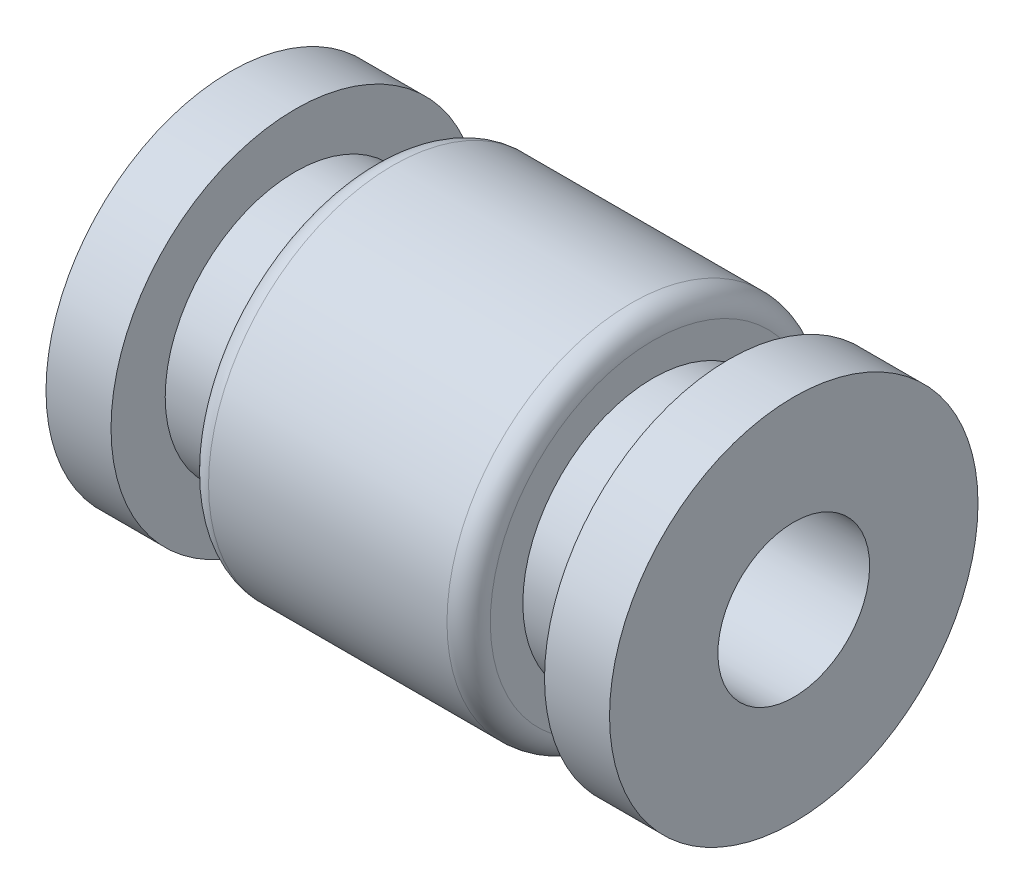
ISO-10303-21;
HEADER;
FILE_DESCRIPTION(('STEP AP214'),'2;1');
FILE_NAME('part.step','',(''),(''),'','','');
FILE_SCHEMA(('AUTOMOTIVE_DESIGN { 1 0 10303 214 1 1 1 1 }'));
ENDSEC;
DATA;
#1=APPLICATION_CONTEXT('core data for automotive mechanical design processes');
#2=APPLICATION_PROTOCOL_DEFINITION('international standard','automotive_design',2000,#1);
#3=PRODUCT_CONTEXT('',#1,'mechanical');
#4=PRODUCT('Part','Part','',(#3));
#5=PRODUCT_RELATED_PRODUCT_CATEGORY('part','',(#4));
#6=PRODUCT_DEFINITION_FORMATION('','',#4);
#7=PRODUCT_DEFINITION_CONTEXT('part definition',#1,'design');
#8=PRODUCT_DEFINITION('design','',#6,#7);
#9=PRODUCT_DEFINITION_SHAPE('','',#8);
#10=(LENGTH_UNIT() NAMED_UNIT(*) SI_UNIT(.MILLI.,.METRE.));
#11=(NAMED_UNIT(*) PLANE_ANGLE_UNIT() SI_UNIT($,.RADIAN.));
#12=(NAMED_UNIT(*) SI_UNIT($,.STERADIAN.) SOLID_ANGLE_UNIT());
#13=UNCERTAINTY_MEASURE_WITH_UNIT(LENGTH_MEASURE(1.E-05),#10,'distance_accuracy_value','');
#14=(GEOMETRIC_REPRESENTATION_CONTEXT(3) GLOBAL_UNCERTAINTY_ASSIGNED_CONTEXT((#13)) GLOBAL_UNIT_ASSIGNED_CONTEXT((#10,
#11,#12)) REPRESENTATION_CONTEXT('',''));
#15=CARTESIAN_POINT('',(0.,0.,0.));
#16=DIRECTION('',(0.,0.,1.));
#17=DIRECTION('',(1.,0.,0.));
#18=AXIS2_PLACEMENT_3D('',#15,#16,#17);
#19=CARTESIAN_POINT('',(-6.5,0.,0.));
#20=DIRECTION('',(-1.,0.,0.));
#21=DIRECTION('',(0.,-1.,0.));
#22=AXIS2_PLACEMENT_3D('',#19,#20,#21);
#23=PLANE('',#22);
#24=CARTESIAN_POINT('',(-6.5,0.,0.));
#25=DIRECTION('',(1.,0.,0.));
#26=DIRECTION('',(0.,1.,0.));
#27=AXIS2_PLACEMENT_3D('',#24,#25,#26);
#28=CIRCLE('',#27,1.75);
#29=CARTESIAN_POINT('',(-6.5,1.75,0.));
#30=VERTEX_POINT('',#29);
#31=EDGE_CURVE('E76',#30,#30,#28,.T.);
#32=ORIENTED_EDGE('',*,*,#31,.T.);
#33=EDGE_LOOP('',(#32));
#34=FACE_BOUND('',#33,.T.);
#35=CARTESIAN_POINT('',(-6.5,0.,0.));
#36=DIRECTION('',(1.,0.,0.));
#37=DIRECTION('',(0.,1.,0.));
#38=AXIS2_PLACEMENT_3D('',#35,#36,#37);
#39=CIRCLE('',#38,4.25);
#40=CARTESIAN_POINT('',(-6.5,4.25,0.));
#41=VERTEX_POINT('',#40);
#42=EDGE_CURVE('E52',#41,#41,#39,.T.);
#43=ORIENTED_EDGE('',*,*,#42,.F.);
#44=EDGE_LOOP('',(#43));
#45=FACE_BOUND('',#44,.T.);
#46=ADVANCED_FACE('F32',(#34,#45),#23,.T.);
#47=CARTESIAN_POINT('',(6.5,0.,0.));
#48=DIRECTION('',(1.,0.,0.));
#49=DIRECTION('',(0.,1.,0.));
#50=AXIS2_PLACEMENT_3D('',#47,#48,#49);
#51=CYLINDRICAL_SURFACE('',#50,4.25);
#52=ORIENTED_EDGE('',*,*,#42,.T.);
#53=EDGE_LOOP('',(#52));
#54=FACE_BOUND('',#53,.T.);
#55=CARTESIAN_POINT('',(-5.,0.,0.));
#56=DIRECTION('',(1.,0.,0.));
#57=DIRECTION('',(0.,1.,0.));
#58=AXIS2_PLACEMENT_3D('',#55,#56,#57);
#59=CIRCLE('',#58,4.25);
#60=CARTESIAN_POINT('',(-5.,4.25,0.));
#61=VERTEX_POINT('',#60);
#62=EDGE_CURVE('E55',#61,#61,#59,.T.);
#63=ORIENTED_EDGE('',*,*,#62,.F.);
#64=EDGE_LOOP('',(#63));
#65=FACE_BOUND('',#64,.T.);
#66=ADVANCED_FACE('F110',(#54,#65),#51,.T.);
#67=CARTESIAN_POINT('',(-5.,4.25,0.));
#68=DIRECTION('',(1.,0.,0.));
#69=DIRECTION('',(0.,1.,0.));
#70=AXIS2_PLACEMENT_3D('',#67,#68,#69);
#71=PLANE('',#70);
#72=ORIENTED_EDGE('',*,*,#62,.T.);
#73=EDGE_LOOP('',(#72));
#74=FACE_BOUND('',#73,.T.);
#75=CARTESIAN_POINT('',(-5.,0.,0.));
#76=DIRECTION('',(1.,0.,0.));
#77=DIRECTION('',(0.,1.,0.));
#78=AXIS2_PLACEMENT_3D('',#75,#76,#77);
#79=CIRCLE('',#78,3.);
#80=CARTESIAN_POINT('',(-5.,3.,0.));
#81=VERTEX_POINT('',#80);
#82=EDGE_CURVE('E58',#81,#81,#79,.T.);
#83=ORIENTED_EDGE('',*,*,#82,.F.);
#84=EDGE_LOOP('',(#83));
#85=FACE_BOUND('',#84,.T.);
#86=ADVANCED_FACE('F115',(#74,#85),#71,.T.);
#87=CARTESIAN_POINT('',(6.5,0.,0.));
#88=DIRECTION('',(1.,0.,0.));
#89=DIRECTION('',(0.,1.,0.));
#90=AXIS2_PLACEMENT_3D('',#87,#88,#89);
#91=CYLINDRICAL_SURFACE('',#90,3.);
#92=ORIENTED_EDGE('',*,*,#82,.T.);
#93=EDGE_LOOP('',(#92));
#94=FACE_BOUND('',#93,.T.);
#95=CARTESIAN_POINT('',(-3.25,0.,0.));
#96=DIRECTION('',(1.,0.,0.));
#97=DIRECTION('',(0.,1.,0.));
#98=AXIS2_PLACEMENT_3D('',#95,#96,#97);
#99=CIRCLE('',#98,3.);
#100=CARTESIAN_POINT('',(-3.25,3.,0.));
#101=VERTEX_POINT('',#100);
#102=EDGE_CURVE('E61',#101,#101,#99,.T.);
#103=ORIENTED_EDGE('',*,*,#102,.F.);
#104=EDGE_LOOP('',(#103));
#105=FACE_BOUND('',#104,.T.);
#106=ADVANCED_FACE('F141',(#94,#105),#91,.T.);
#107=CARTESIAN_POINT('',(-3.25,3.,0.));
#108=DIRECTION('',(-1.,0.,0.));
#109=DIRECTION('',(0.,-1.,0.));
#110=AXIS2_PLACEMENT_3D('',#107,#108,#109);
#111=PLANE('',#110);
#112=CARTESIAN_POINT('',(-3.25,0.,0.));
#113=DIRECTION('',(-1.,0.,0.));
#114=DIRECTION('',(0.,-1.,0.));
#115=AXIS2_PLACEMENT_3D('',#112,#113,#114);
#116=CIRCLE('',#115,3.75);
#117=CARTESIAN_POINT('',(-3.25,-3.75,0.));
#118=VERTEX_POINT('',#117);
#119=EDGE_CURVE('E39',#118,#118,#116,.T.);
#120=ORIENTED_EDGE('',*,*,#119,.T.);
#121=EDGE_LOOP('',(#120));
#122=FACE_BOUND('',#121,.T.);
#123=ORIENTED_EDGE('',*,*,#102,.T.);
#124=EDGE_LOOP('',(#123));
#125=FACE_BOUND('',#124,.T.);
#126=ADVANCED_FACE('F132',(#122,#125),#111,.T.);
#127=CARTESIAN_POINT('',(6.5,0.,0.));
#128=DIRECTION('',(1.,0.,0.));
#129=DIRECTION('',(0.,1.,0.));
#130=AXIS2_PLACEMENT_3D('',#127,#128,#129);
#131=CYLINDRICAL_SURFACE('',#130,4.25);
#132=CARTESIAN_POINT('',(-2.75,0.,0.));
#133=DIRECTION('',(-1.,0.,0.));
#134=DIRECTION('',(0.,-1.,0.));
#135=AXIS2_PLACEMENT_3D('',#132,#133,#134);
#136=CIRCLE('',#135,4.25);
#137=CARTESIAN_POINT('',(-2.75,-4.25,0.));
#138=VERTEX_POINT('',#137);
#139=EDGE_CURVE('E43',#138,#138,#136,.F.);
#140=ORIENTED_EDGE('',*,*,#139,.T.);
#141=EDGE_LOOP('',(#140));
#142=FACE_BOUND('',#141,.T.);
#143=CARTESIAN_POINT('',(2.75,0.,0.));
#144=DIRECTION('',(1.,0.,0.));
#145=DIRECTION('',(0.,1.,0.));
#146=AXIS2_PLACEMENT_3D('',#143,#144,#145);
#147=CIRCLE('',#146,4.25);
#148=CARTESIAN_POINT('',(2.75,4.25,0.));
#149=VERTEX_POINT('',#148);
#150=EDGE_CURVE('E47',#149,#149,#147,.F.);
#151=ORIENTED_EDGE('',*,*,#150,.T.);
#152=EDGE_LOOP('',(#151));
#153=FACE_BOUND('',#152,.T.);
#154=ADVANCED_FACE('F128',(#142,#153),#131,.T.);
#155=CARTESIAN_POINT('',(3.25,4.25,0.));
#156=DIRECTION('',(1.,0.,0.));
#157=DIRECTION('',(0.,1.,0.));
#158=AXIS2_PLACEMENT_3D('',#155,#156,#157);
#159=PLANE('',#158);
#160=CARTESIAN_POINT('',(3.25,0.,0.));
#161=DIRECTION('',(1.,0.,0.));
#162=DIRECTION('',(0.,1.,0.));
#163=AXIS2_PLACEMENT_3D('',#160,#161,#162);
#164=CIRCLE('',#163,3.75);
#165=CARTESIAN_POINT('',(3.25,3.75,0.));
#166=VERTEX_POINT('',#165);
#167=EDGE_CURVE('E10',#166,#166,#164,.T.);
#168=ORIENTED_EDGE('',*,*,#167,.T.);
#169=EDGE_LOOP('',(#168));
#170=FACE_BOUND('',#169,.T.);
#171=CARTESIAN_POINT('',(3.25,0.,0.));
#172=DIRECTION('',(1.,0.,0.));
#173=DIRECTION('',(0.,1.,0.));
#174=AXIS2_PLACEMENT_3D('',#171,#172,#173);
#175=CIRCLE('',#174,3.);
#176=CARTESIAN_POINT('',(3.25,3.,0.));
#177=VERTEX_POINT('',#176);
#178=EDGE_CURVE('E64',#177,#177,#175,.T.);
#179=ORIENTED_EDGE('',*,*,#178,.F.);
#180=EDGE_LOOP('',(#179));
#181=FACE_BOUND('',#180,.T.);
#182=ADVANCED_FACE('F131',(#170,#181),#159,.T.);
#183=CARTESIAN_POINT('',(6.5,0.,0.));
#184=DIRECTION('',(1.,0.,0.));
#185=DIRECTION('',(0.,1.,0.));
#186=AXIS2_PLACEMENT_3D('',#183,#184,#185);
#187=CYLINDRICAL_SURFACE('',#186,3.);
#188=ORIENTED_EDGE('',*,*,#178,.T.);
#189=EDGE_LOOP('',(#188));
#190=FACE_BOUND('',#189,.T.);
#191=CARTESIAN_POINT('',(5.,0.,0.));
#192=DIRECTION('',(1.,0.,0.));
#193=DIRECTION('',(0.,1.,0.));
#194=AXIS2_PLACEMENT_3D('',#191,#192,#193);
#195=CIRCLE('',#194,3.);
#196=CARTESIAN_POINT('',(5.,3.,0.));
#197=VERTEX_POINT('',#196);
#198=EDGE_CURVE('E67',#197,#197,#195,.T.);
#199=ORIENTED_EDGE('',*,*,#198,.F.);
#200=EDGE_LOOP('',(#199));
#201=FACE_BOUND('',#200,.T.);
#202=ADVANCED_FACE('F106',(#190,#201),#187,.T.);
#203=CARTESIAN_POINT('',(5.,3.,0.));
#204=DIRECTION('',(-1.,0.,0.));
#205=DIRECTION('',(0.,-1.,0.));
#206=AXIS2_PLACEMENT_3D('',#203,#204,#205);
#207=PLANE('',#206);
#208=ORIENTED_EDGE('',*,*,#198,.T.);
#209=EDGE_LOOP('',(#208));
#210=FACE_BOUND('',#209,.T.);
#211=CARTESIAN_POINT('',(5.,0.,0.));
#212=DIRECTION('',(1.,0.,0.));
#213=DIRECTION('',(0.,1.,0.));
#214=AXIS2_PLACEMENT_3D('',#211,#212,#213);
#215=CIRCLE('',#214,4.25);
#216=CARTESIAN_POINT('',(5.,4.25,0.));
#217=VERTEX_POINT('',#216);
#218=EDGE_CURVE('E70',#217,#217,#215,.T.);
#219=ORIENTED_EDGE('',*,*,#218,.F.);
#220=EDGE_LOOP('',(#219));
#221=FACE_BOUND('',#220,.T.);
#222=ADVANCED_FACE('F100',(#210,#221),#207,.T.);
#223=CARTESIAN_POINT('',(6.5,0.,0.));
#224=DIRECTION('',(1.,0.,0.));
#225=DIRECTION('',(0.,1.,0.));
#226=AXIS2_PLACEMENT_3D('',#223,#224,#225);
#227=CYLINDRICAL_SURFACE('',#226,4.25);
#228=ORIENTED_EDGE('',*,*,#218,.T.);
#229=EDGE_LOOP('',(#228));
#230=FACE_BOUND('',#229,.T.);
#231=CARTESIAN_POINT('',(6.5,0.,0.));
#232=DIRECTION('',(1.,0.,0.));
#233=DIRECTION('',(0.,1.,0.));
#234=AXIS2_PLACEMENT_3D('',#231,#232,#233);
#235=CIRCLE('',#234,4.25);
#236=CARTESIAN_POINT('',(6.5,4.25,0.));
#237=VERTEX_POINT('',#236);
#238=EDGE_CURVE('E73',#237,#237,#235,.T.);
#239=ORIENTED_EDGE('',*,*,#238,.F.);
#240=EDGE_LOOP('',(#239));
#241=FACE_BOUND('',#240,.T.);
#242=ADVANCED_FACE('F95',(#230,#241),#227,.T.);
#243=CARTESIAN_POINT('',(6.5,4.25,0.));
#244=DIRECTION('',(1.,0.,0.));
#245=DIRECTION('',(0.,1.,0.));
#246=AXIS2_PLACEMENT_3D('',#243,#244,#245);
#247=PLANE('',#246);
#248=CARTESIAN_POINT('',(6.5,0.,0.));
#249=DIRECTION('',(1.,0.,0.));
#250=DIRECTION('',(0.,1.,0.));
#251=AXIS2_PLACEMENT_3D('',#248,#249,#250);
#252=CIRCLE('',#251,1.75);
#253=CARTESIAN_POINT('',(6.5,1.75,0.));
#254=VERTEX_POINT('',#253);
#255=EDGE_CURVE('E77',#254,#254,#252,.T.);
#256=ORIENTED_EDGE('',*,*,#255,.F.);
#257=EDGE_LOOP('',(#256));
#258=FACE_BOUND('',#257,.T.);
#259=ORIENTED_EDGE('',*,*,#238,.T.);
#260=EDGE_LOOP('',(#259));
#261=FACE_BOUND('',#260,.T.);
#262=ADVANCED_FACE('F89',(#258,#261),#247,.T.);
#263=CARTESIAN_POINT('',(-6.5,0.,0.));
#264=DIRECTION('',(1.,0.,0.));
#265=DIRECTION('',(0.,1.,0.));
#266=AXIS2_PLACEMENT_3D('',#263,#264,#265);
#267=CYLINDRICAL_SURFACE('',#266,1.75);
#268=ORIENTED_EDGE('',*,*,#31,.F.);
#269=EDGE_LOOP('',(#268));
#270=FACE_BOUND('',#269,.T.);
#271=ORIENTED_EDGE('',*,*,#255,.T.);
#272=EDGE_LOOP('',(#271));
#273=FACE_BOUND('',#272,.T.);
#274=ADVANCED_FACE('F85',(#270,#273),#267,.F.);
#275=CARTESIAN_POINT('',(-2.75,0.,0.));
#276=DIRECTION('',(-1.,0.,0.));
#277=DIRECTION('',(0.,-1.,0.));
#278=AXIS2_PLACEMENT_3D('',#275,#276,#277);
#279=TOROIDAL_SURFACE('',#278,3.75,0.5);
#280=ORIENTED_EDGE('',*,*,#119,.F.);
#281=EDGE_LOOP('',(#280));
#282=FACE_BOUND('',#281,.T.);
#283=ORIENTED_EDGE('',*,*,#139,.F.);
#284=EDGE_LOOP('',(#283));
#285=FACE_BOUND('',#284,.T.);
#286=ADVANCED_FACE('F88',(#282,#285),#279,.T.);
#287=CARTESIAN_POINT('',(2.75,0.,0.));
#288=DIRECTION('',(1.,0.,0.));
#289=DIRECTION('',(0.,1.,0.));
#290=AXIS2_PLACEMENT_3D('',#287,#288,#289);
#291=TOROIDAL_SURFACE('',#290,3.75,0.5);
#292=ORIENTED_EDGE('',*,*,#150,.F.);
#293=EDGE_LOOP('',(#292));
#294=FACE_BOUND('',#293,.T.);
#295=ORIENTED_EDGE('',*,*,#167,.F.);
#296=EDGE_LOOP('',(#295));
#297=FACE_BOUND('',#296,.T.);
#298=ADVANCED_FACE('F34',(#294,#297),#291,.T.);
#299=CLOSED_SHELL('',(#46,#66,#86,#106,#126,#154,#182,#202,#222,#242,#262,#274,#286,#298));
#300=MANIFOLD_SOLID_BREP('B2',#299);
#301=ADVANCED_BREP_SHAPE_REPRESENTATION('',(#18,#300),#14);
#302=SHAPE_DEFINITION_REPRESENTATION(#9,#301);
ENDSEC;
END-ISO-10303-21;
